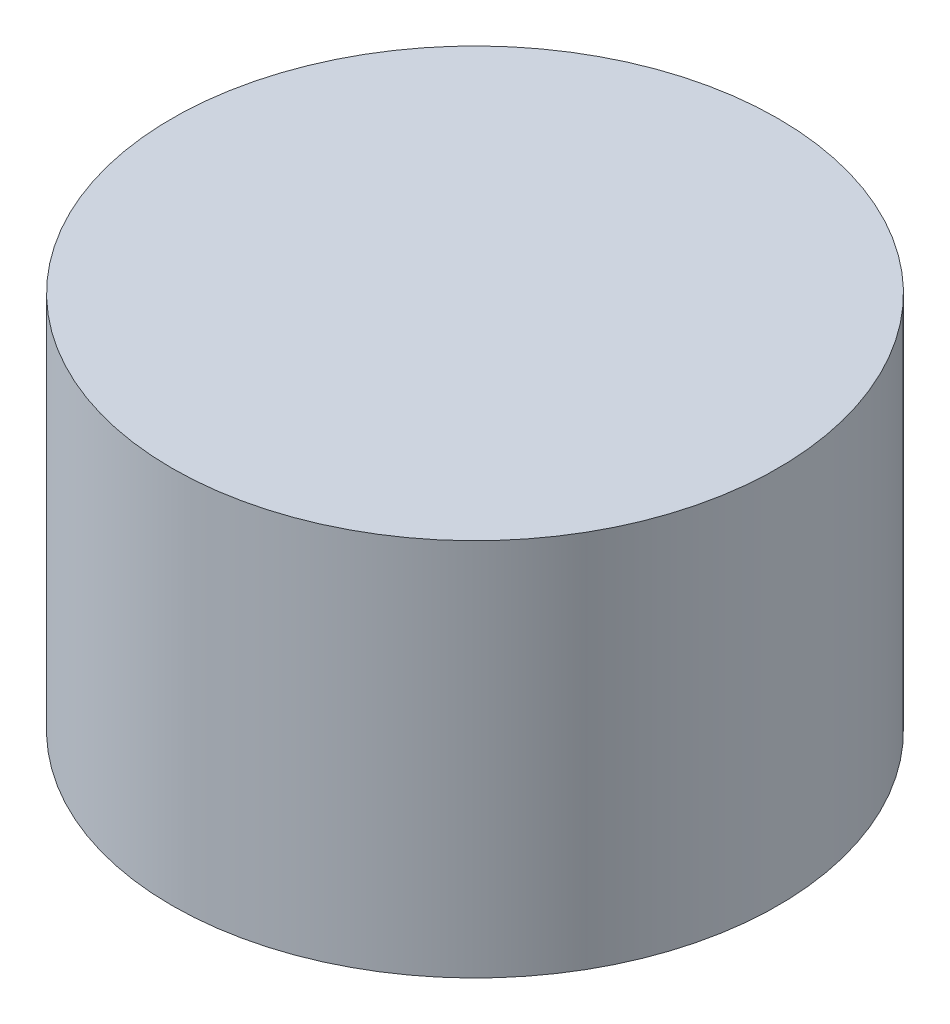
ISO-10303-21;
HEADER;
FILE_DESCRIPTION(('STEP AP214'),'2;1');
FILE_NAME('part.step','',(''),(''),'','','');
FILE_SCHEMA(('AUTOMOTIVE_DESIGN { 1 0 10303 214 1 1 1 1 }'));
ENDSEC;
DATA;
#1=APPLICATION_CONTEXT('core data for automotive mechanical design processes');
#2=APPLICATION_PROTOCOL_DEFINITION('international standard','automotive_design',2000,#1);
#3=PRODUCT_CONTEXT('',#1,'mechanical');
#4=PRODUCT('Part','Part','',(#3));
#5=PRODUCT_RELATED_PRODUCT_CATEGORY('part','',(#4));
#6=PRODUCT_DEFINITION_FORMATION('','',#4);
#7=PRODUCT_DEFINITION_CONTEXT('part definition',#1,'design');
#8=PRODUCT_DEFINITION('design','',#6,#7);
#9=PRODUCT_DEFINITION_SHAPE('','',#8);
#10=(LENGTH_UNIT() NAMED_UNIT(*) SI_UNIT(.MILLI.,.METRE.));
#11=(NAMED_UNIT(*) PLANE_ANGLE_UNIT() SI_UNIT($,.RADIAN.));
#12=(NAMED_UNIT(*) SI_UNIT($,.STERADIAN.) SOLID_ANGLE_UNIT());
#13=UNCERTAINTY_MEASURE_WITH_UNIT(LENGTH_MEASURE(1.E-05),#10,'distance_accuracy_value','');
#14=(GEOMETRIC_REPRESENTATION_CONTEXT(3) GLOBAL_UNCERTAINTY_ASSIGNED_CONTEXT((#13)) GLOBAL_UNIT_ASSIGNED_CONTEXT((#10,
#11,#12)) REPRESENTATION_CONTEXT('',''));
#15=CARTESIAN_POINT('',(0.,0.,0.));
#16=DIRECTION('',(0.,0.,1.));
#17=DIRECTION('',(1.,0.,0.));
#18=AXIS2_PLACEMENT_3D('',#15,#16,#17);
#19=CARTESIAN_POINT('',(0.,50.,0.));
#20=DIRECTION('',(0.,-1.,0.));
#21=DIRECTION('',(0.,0.,-1.));
#22=AXIS2_PLACEMENT_3D('',#19,#20,#21);
#23=CYLINDRICAL_SURFACE('',#22,40.);
#24=CARTESIAN_POINT('',(0.,50.,0.));
#25=DIRECTION('',(0.,1.,0.));
#26=DIRECTION('',(0.,0.,1.));
#27=AXIS2_PLACEMENT_3D('',#24,#25,#26);
#28=CIRCLE('',#27,40.);
#29=CARTESIAN_POINT('',(0.,50.,40.));
#30=VERTEX_POINT('',#29);
#31=EDGE_CURVE('E10',#30,#30,#28,.T.);
#32=ORIENTED_EDGE('',*,*,#31,.F.);
#33=EDGE_LOOP('',(#32));
#34=FACE_BOUND('',#33,.T.);
#35=CARTESIAN_POINT('',(0.,0.,0.));
#36=DIRECTION('',(0.,1.,0.));
#37=DIRECTION('',(0.,0.,1.));
#38=AXIS2_PLACEMENT_3D('',#35,#36,#37);
#39=CIRCLE('',#38,40.);
#40=CARTESIAN_POINT('',(0.,0.,40.));
#41=VERTEX_POINT('',#40);
#42=EDGE_CURVE('E34',#41,#41,#39,.T.);
#43=ORIENTED_EDGE('',*,*,#42,.T.);
#44=EDGE_LOOP('',(#43));
#45=FACE_BOUND('',#44,.T.);
#46=ADVANCED_FACE('F31',(#34,#45),#23,.T.);
#47=CARTESIAN_POINT('',(0.,50.,0.));
#48=DIRECTION('',(0.,1.,0.));
#49=DIRECTION('',(0.,0.,1.));
#50=AXIS2_PLACEMENT_3D('',#47,#48,#49);
#51=PLANE('',#50);
#52=ORIENTED_EDGE('',*,*,#31,.T.);
#53=EDGE_LOOP('',(#52));
#54=FACE_BOUND('',#53,.T.);
#55=ADVANCED_FACE('F46',(#54),#51,.T.);
#56=CARTESIAN_POINT('',(0.,0.,0.));
#57=DIRECTION('',(0.,1.,0.));
#58=DIRECTION('',(0.,0.,1.));
#59=AXIS2_PLACEMENT_3D('',#56,#57,#58);
#60=PLANE('',#59);
#61=ORIENTED_EDGE('',*,*,#42,.F.);
#62=EDGE_LOOP('',(#61));
#63=FACE_BOUND('',#62,.T.);
#64=ADVANCED_FACE('F44',(#63),#60,.F.);
#65=CLOSED_SHELL('',(#46,#55,#64));
#66=MANIFOLD_SOLID_BREP('B2',#65);
#67=ADVANCED_BREP_SHAPE_REPRESENTATION('',(#18,#66),#14);
#68=SHAPE_DEFINITION_REPRESENTATION(#9,#67);
ENDSEC;
END-ISO-10303-21;
